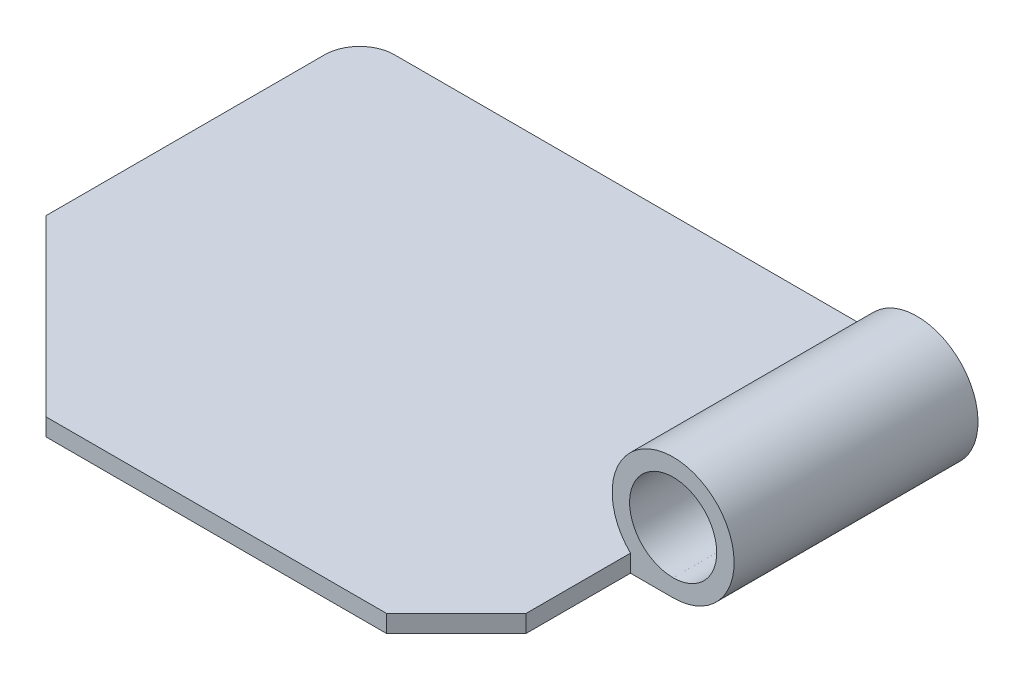
ISO-10303-21;
HEADER;
FILE_DESCRIPTION(('STEP AP214'),'2;1');
FILE_NAME('part.step','',(''),(''),'','','');
FILE_SCHEMA(('AUTOMOTIVE_DESIGN { 1 0 10303 214 1 1 1 1 }'));
ENDSEC;
DATA;
#1=APPLICATION_CONTEXT('core data for automotive mechanical design processes');
#2=APPLICATION_PROTOCOL_DEFINITION('international standard','automotive_design',2000,#1);
#3=PRODUCT_CONTEXT('',#1,'mechanical');
#4=PRODUCT('Part','Part','',(#3));
#5=PRODUCT_RELATED_PRODUCT_CATEGORY('part','',(#4));
#6=PRODUCT_DEFINITION_FORMATION('','',#4);
#7=PRODUCT_DEFINITION_CONTEXT('part definition',#1,'design');
#8=PRODUCT_DEFINITION('design','',#6,#7);
#9=PRODUCT_DEFINITION_SHAPE('','',#8);
#10=(LENGTH_UNIT() NAMED_UNIT(*) SI_UNIT(.MILLI.,.METRE.));
#11=(NAMED_UNIT(*) PLANE_ANGLE_UNIT() SI_UNIT($,.RADIAN.));
#12=(NAMED_UNIT(*) SI_UNIT($,.STERADIAN.) SOLID_ANGLE_UNIT());
#13=UNCERTAINTY_MEASURE_WITH_UNIT(LENGTH_MEASURE(1.E-05),#10,'distance_accuracy_value','');
#14=(GEOMETRIC_REPRESENTATION_CONTEXT(3) GLOBAL_UNCERTAINTY_ASSIGNED_CONTEXT((#13)) GLOBAL_UNIT_ASSIGNED_CONTEXT((#10,
#11,#12)) REPRESENTATION_CONTEXT('',''));
#15=CARTESIAN_POINT('',(0.,0.,0.));
#16=DIRECTION('',(0.,0.,1.));
#17=DIRECTION('',(1.,0.,0.));
#18=AXIS2_PLACEMENT_3D('',#15,#16,#17);
#19=CARTESIAN_POINT('',(-39.9995204977007,0.,-129.999520497701));
#20=DIRECTION('',(0.,-1.,0.));
#21=DIRECTION('',(0.,0.,-1.));
#22=AXIS2_PLACEMENT_3D('',#19,#20,#21);
#23=PLANE('',#22);
#24=DIRECTION('',(1.,0.,0.));
#25=VECTOR('',#24,1.);
#26=CARTESIAN_POINT('',(-39.9995204977007,0.,-49.9969797719556));
#27=LINE('',#26,#25);
#28=CARTESIAN_POINT('',(117.74001933084,0.,-49.9969797719556));
#29=VERTEX_POINT('',#28);
#30=CARTESIAN_POINT('',(117.746979771956,0.,-49.9969797719556));
#31=VERTEX_POINT('',#30);
#32=EDGE_CURVE('E11',#29,#31,#27,.T.);
#33=ORIENTED_EDGE('',*,*,#32,.F.);
#34=DIRECTION('',(0.,0.,-1.));
#35=VECTOR('',#34,1.);
#36=CARTESIAN_POINT('',(117.74001933084,0.,-49.9969797719556));
#37=LINE('',#36,#35);
#38=CARTESIAN_POINT('',(117.74001933084,0.,-119.996979771956));
#39=VERTEX_POINT('',#38);
#40=EDGE_CURVE('E46',#29,#39,#37,.T.);
#41=ORIENTED_EDGE('',*,*,#40,.T.);
#42=DIRECTION('',(1.,0.,0.));
#43=VECTOR('',#42,1.);
#44=CARTESIAN_POINT('',(-39.9995204977007,0.,-119.996979771956));
#45=LINE('',#44,#43);
#46=CARTESIAN_POINT('',(117.750479502299,0.,-119.996979771956));
#47=VERTEX_POINT('',#46);
#48=EDGE_CURVE('E191',#39,#47,#45,.T.);
#49=ORIENTED_EDGE('',*,*,#48,.T.);
#50=DIRECTION('',(0.,0.,-1.));
#51=VECTOR('',#50,1.);
#52=CARTESIAN_POINT('',(117.750479502299,0.,-119.996979771956));
#53=LINE('',#52,#51);
#54=CARTESIAN_POINT('',(117.750479502299,0.,-139.999520497701));
#55=VERTEX_POINT('',#54);
#56=EDGE_CURVE('E158',#47,#55,#53,.T.);
#57=ORIENTED_EDGE('',*,*,#56,.T.);
#58=DIRECTION('',(-1.,0.,0.));
#59=VECTOR('',#58,1.);
#60=CARTESIAN_POINT('',(117.750479502299,0.,-139.999520497701));
#61=LINE('',#60,#59);
#62=CARTESIAN_POINT('',(-39.9995204977007,0.,-139.999520497701));
#63=VERTEX_POINT('',#62);
#64=EDGE_CURVE('E161',#55,#63,#61,.T.);
#65=ORIENTED_EDGE('',*,*,#64,.T.);
#66=CARTESIAN_POINT('',(-39.9995204977007,0.,-129.999520497701));
#67=DIRECTION('',(0.,1.,0.));
#68=DIRECTION('',(0.,0.,-1.));
#69=AXIS2_PLACEMENT_3D('',#66,#67,#68);
#70=CIRCLE('',#69,10.);
#71=CARTESIAN_POINT('',(-49.9995204977007,0.,-129.999520497701));
#72=VERTEX_POINT('',#71);
#73=EDGE_CURVE('E164',#63,#72,#70,.T.);
#74=ORIENTED_EDGE('',*,*,#73,.T.);
#75=DIRECTION('',(0.,0.,1.));
#76=VECTOR('',#75,1.);
#77=CARTESIAN_POINT('',(-49.9995204977007,0.,-129.999520497701));
#78=LINE('',#77,#76);
#79=CARTESIAN_POINT('',(-49.9995204977007,0.,-49.9995204977008));
#80=VERTEX_POINT('',#79);
#81=EDGE_CURVE('E167',#72,#80,#78,.T.);
#82=ORIENTED_EDGE('',*,*,#81,.T.);
#83=DIRECTION('',(0.707106781186546,0.,0.707106781186549));
#84=VECTOR('',#83,1.);
#85=CARTESIAN_POINT('',(-49.9995204977007,0.,-49.9995204977008));
#86=LINE('',#85,#84);
#87=CARTESIAN_POINT('',(0.,0.,0.));
#88=VERTEX_POINT('',#87);
#89=EDGE_CURVE('E220',#80,#88,#86,.T.);
#90=ORIENTED_EDGE('',*,*,#89,.T.);
#91=DIRECTION('',(1.,0.,0.));
#92=VECTOR('',#91,1.);
#93=CARTESIAN_POINT('',(0.,0.,0.));
#94=LINE('',#93,#92);
#95=CARTESIAN_POINT('',(97.75,0.,0.));
#96=VERTEX_POINT('',#95);
#97=EDGE_CURVE('E223',#88,#96,#94,.T.);
#98=ORIENTED_EDGE('',*,*,#97,.T.);
#99=DIRECTION('',(0.707106781186547,0.,-0.707106781186548));
#100=VECTOR('',#99,1.);
#101=CARTESIAN_POINT('',(97.75,0.,0.));
#102=LINE('',#101,#100);
#103=CARTESIAN_POINT('',(117.746979771956,0.,-19.9969797719556));
#104=VERTEX_POINT('',#103);
#105=EDGE_CURVE('E153',#96,#104,#102,.T.);
#106=ORIENTED_EDGE('',*,*,#105,.T.);
#107=DIRECTION('',(0.,0.,-1.));
#108=VECTOR('',#107,1.);
#109=CARTESIAN_POINT('',(117.746979771956,0.,-19.9969797719556));
#110=LINE('',#109,#108);
#111=EDGE_CURVE('E151',#104,#31,#110,.T.);
#112=ORIENTED_EDGE('',*,*,#111,.T.);
#113=EDGE_LOOP('',(#33,#41,#49,#57,#65,#74,#82,#90,#98,#106,#112));
#114=FACE_BOUND('',#113,.T.);
#115=ADVANCED_FACE('F38',(#114),#23,.F.);
#116=DIRECTION('',(0.,0.,-1.));
#117=VECTOR('',#116,1.);
#118=CARTESIAN_POINT('',(129.987472977843,-2.41671002654265E-06,-49.9969797719556));
#119=LINE('',#118,#117);
#120=CARTESIAN_POINT('',(129.987472977843,0.,-49.9969797719556));
#121=VERTEX_POINT('',#120);
#122=CARTESIAN_POINT('',(129.987472977843,-4.83342005482001E-06,-119.996979771956));
#123=VERTEX_POINT('',#122);
#124=EDGE_CURVE('E150',#121,#123,#119,.T.);
#125=ORIENTED_EDGE('',*,*,#124,.F.);
#126=DIRECTION('',(1.,0.,0.));
#127=VECTOR('',#126,1.);
#128=CARTESIAN_POINT('',(117.746979771956,0.,-49.9969797719556));
#129=LINE('',#128,#127);
#130=CARTESIAN_POINT('',(130.000479502299,0.,-49.9969797719556));
#131=VERTEX_POINT('',#130);
#132=EDGE_CURVE('E141',#121,#131,#129,.T.);
#133=ORIENTED_EDGE('',*,*,#132,.T.);
#134=DIRECTION('',(0.,0.,-1.));
#135=VECTOR('',#134,1.);
#136=CARTESIAN_POINT('',(130.000479502299,0.,-49.9969797719556));
#137=LINE('',#136,#135);
#138=CARTESIAN_POINT('',(130.000479502299,0.,-119.996979771956));
#139=VERTEX_POINT('',#138);
#140=EDGE_CURVE('E130',#131,#139,#137,.T.);
#141=ORIENTED_EDGE('',*,*,#140,.T.);
#142=DIRECTION('',(-1.,0.,0.));
#143=VECTOR('',#142,1.);
#144=CARTESIAN_POINT('',(117.750479502299,0.,-119.996979771956));
#145=LINE('',#144,#143);
#146=EDGE_CURVE('E140',#139,#123,#145,.T.);
#147=ORIENTED_EDGE('',*,*,#146,.T.);
#148=EDGE_LOOP('',(#125,#133,#141,#147));
#149=FACE_BOUND('',#148,.T.);
#150=ADVANCED_FACE('F149',(#149),#23,.F.);
#151=CARTESIAN_POINT('',(-49.9995204977007,-5.,-49.9995204977008));
#152=DIRECTION('',(-0.707106781186549,0.,0.707106781186546));
#153=DIRECTION('',(0.707106781186546,0.,0.707106781186549));
#154=AXIS2_PLACEMENT_3D('',#151,#152,#153);
#155=PLANE('',#154);
#156=ORIENTED_EDGE('',*,*,#89,.F.);
#157=DIRECTION('',(0.,1.,0.));
#158=VECTOR('',#157,1.);
#159=CARTESIAN_POINT('',(-49.9995204977007,-5.,-49.9995204977008));
#160=LINE('',#159,#158);
#161=CARTESIAN_POINT('',(-49.9995204977007,-5.,-49.9995204977008));
#162=VERTEX_POINT('',#161);
#163=EDGE_CURVE('E171',#162,#80,#160,.T.);
#164=ORIENTED_EDGE('',*,*,#163,.F.);
#165=DIRECTION('',(0.707106781186546,0.,0.707106781186549));
#166=VECTOR('',#165,1.);
#167=CARTESIAN_POINT('',(-49.9995204977007,-5.,-49.9995204977008));
#168=LINE('',#167,#166);
#169=CARTESIAN_POINT('',(0.,-5.,0.));
#170=VERTEX_POINT('',#169);
#171=EDGE_CURVE('E170',#162,#170,#168,.T.);
#172=ORIENTED_EDGE('',*,*,#171,.T.);
#173=DIRECTION('',(0.,1.,0.));
#174=VECTOR('',#173,1.);
#175=CARTESIAN_POINT('',(0.,-5.,0.));
#176=LINE('',#175,#174);
#177=EDGE_CURVE('E187',#170,#88,#176,.T.);
#178=ORIENTED_EDGE('',*,*,#177,.T.);
#179=EDGE_LOOP('',(#156,#164,#172,#178));
#180=FACE_BOUND('',#179,.T.);
#181=ADVANCED_FACE('F40',(#180),#155,.T.);
#182=CARTESIAN_POINT('',(-49.9995204977007,-5.,-129.999520497701));
#183=DIRECTION('',(-1.,0.,0.));
#184=DIRECTION('',(0.,0.,1.));
#185=AXIS2_PLACEMENT_3D('',#182,#183,#184);
#186=PLANE('',#185);
#187=ORIENTED_EDGE('',*,*,#81,.F.);
#188=DIRECTION('',(0.,1.,0.));
#189=VECTOR('',#188,1.);
#190=CARTESIAN_POINT('',(-49.9995204977007,-5.,-129.999520497701));
#191=LINE('',#190,#189);
#192=CARTESIAN_POINT('',(-49.9995204977007,-5.,-129.999520497701));
#193=VERTEX_POINT('',#192);
#194=EDGE_CURVE('E173',#193,#72,#191,.T.);
#195=ORIENTED_EDGE('',*,*,#194,.F.);
#196=DIRECTION('',(0.,0.,1.));
#197=VECTOR('',#196,1.);
#198=CARTESIAN_POINT('',(-49.9995204977007,-5.,-129.999520497701));
#199=LINE('',#198,#197);
#200=EDGE_CURVE('E189',#193,#162,#199,.T.);
#201=ORIENTED_EDGE('',*,*,#200,.T.);
#202=ORIENTED_EDGE('',*,*,#163,.T.);
#203=EDGE_LOOP('',(#187,#195,#201,#202));
#204=FACE_BOUND('',#203,.T.);
#205=ADVANCED_FACE('F212',(#204),#186,.T.);
#206=CARTESIAN_POINT('',(-39.9995204977007,-5.,-129.999520497701));
#207=DIRECTION('',(0.,1.,0.));
#208=DIRECTION('',(0.,0.,1.));
#209=AXIS2_PLACEMENT_3D('',#206,#207,#208);
#210=CYLINDRICAL_SURFACE('',#209,10.);
#211=ORIENTED_EDGE('',*,*,#73,.F.);
#212=DIRECTION('',(0.,1.,0.));
#213=VECTOR('',#212,1.);
#214=CARTESIAN_POINT('',(-39.9995204977007,-5.,-139.999520497701));
#215=LINE('',#214,#213);
#216=CARTESIAN_POINT('',(-39.9995204977007,-5.,-139.999520497701));
#217=VERTEX_POINT('',#216);
#218=EDGE_CURVE('E175',#217,#63,#215,.T.);
#219=ORIENTED_EDGE('',*,*,#218,.F.);
#220=CARTESIAN_POINT('',(-39.9995204977007,-5.,-129.999520497701));
#221=DIRECTION('',(0.,1.,0.));
#222=DIRECTION('',(0.,0.,-1.));
#223=AXIS2_PLACEMENT_3D('',#220,#221,#222);
#224=CIRCLE('',#223,10.);
#225=EDGE_CURVE('E261',#217,#193,#224,.T.);
#226=ORIENTED_EDGE('',*,*,#225,.T.);
#227=ORIENTED_EDGE('',*,*,#194,.T.);
#228=EDGE_LOOP('',(#211,#219,#226,#227));
#229=FACE_BOUND('',#228,.T.);
#230=ADVANCED_FACE('F263',(#229),#210,.T.);
#231=CARTESIAN_POINT('',(117.750479502299,-5.,-139.999520497701));
#232=DIRECTION('',(0.,0.,-1.));
#233=DIRECTION('',(-1.,0.,0.));
#234=AXIS2_PLACEMENT_3D('',#231,#232,#233);
#235=PLANE('',#234);
#236=ORIENTED_EDGE('',*,*,#64,.F.);
#237=DIRECTION('',(0.,1.,0.));
#238=VECTOR('',#237,1.);
#239=CARTESIAN_POINT('',(117.750479502299,-5.,-139.999520497701));
#240=LINE('',#239,#238);
#241=CARTESIAN_POINT('',(117.750479502299,-5.,-139.999520497701));
#242=VERTEX_POINT('',#241);
#243=EDGE_CURVE('E177',#242,#55,#240,.T.);
#244=ORIENTED_EDGE('',*,*,#243,.F.);
#245=DIRECTION('',(-1.,0.,0.));
#246=VECTOR('',#245,1.);
#247=CARTESIAN_POINT('',(117.750479502299,-5.,-139.999520497701));
#248=LINE('',#247,#246);
#249=EDGE_CURVE('E260',#242,#217,#248,.T.);
#250=ORIENTED_EDGE('',*,*,#249,.T.);
#251=ORIENTED_EDGE('',*,*,#218,.T.);
#252=EDGE_LOOP('',(#236,#244,#250,#251));
#253=FACE_BOUND('',#252,.T.);
#254=ADVANCED_FACE('F206',(#253),#235,.T.);
#255=CARTESIAN_POINT('',(117.750479502299,-5.,-119.996979771956));
#256=DIRECTION('',(1.,0.,0.));
#257=DIRECTION('',(0.,0.,-1.));
#258=AXIS2_PLACEMENT_3D('',#255,#256,#257);
#259=PLANE('',#258);
#260=ORIENTED_EDGE('',*,*,#56,.F.);
#261=DIRECTION('',(0.,1.,0.));
#262=VECTOR('',#261,1.);
#263=CARTESIAN_POINT('',(117.750479502299,-5.,-119.996979771956));
#264=LINE('',#263,#262);
#265=CARTESIAN_POINT('',(117.750479502299,-5.,-119.996979771956));
#266=VERTEX_POINT('',#265);
#267=EDGE_CURVE('E179',#266,#47,#264,.T.);
#268=ORIENTED_EDGE('',*,*,#267,.F.);
#269=DIRECTION('',(0.,0.,-1.));
#270=VECTOR('',#269,1.);
#271=CARTESIAN_POINT('',(117.750479502299,-5.,-119.996979771956));
#272=LINE('',#271,#270);
#273=EDGE_CURVE('E202',#266,#242,#272,.T.);
#274=ORIENTED_EDGE('',*,*,#273,.T.);
#275=ORIENTED_EDGE('',*,*,#243,.T.);
#276=EDGE_LOOP('',(#260,#268,#274,#275));
#277=FACE_BOUND('',#276,.T.);
#278=ADVANCED_FACE('F198',(#277),#259,.T.);
#279=CARTESIAN_POINT('',(117.750479502299,-5.,-119.996979771956));
#280=DIRECTION('',(0.,0.,-1.));
#281=DIRECTION('',(-1.,0.,0.));
#282=AXIS2_PLACEMENT_3D('',#279,#280,#281);
#283=PLANE('',#282);
#284=ORIENTED_EDGE('',*,*,#267,.T.);
#285=ORIENTED_EDGE('',*,*,#48,.F.);
#286=CARTESIAN_POINT('',(129.987472977843,12.4999951665799,-119.996979771956));
#287=DIRECTION('',(0.,0.,-1.));
#288=DIRECTION('',(-1.,0.,0.));
#289=AXIS2_PLACEMENT_3D('',#286,#287,#288);
#290=CIRCLE('',#289,17.5);
#291=CARTESIAN_POINT('',(130.000479502299,-5.,-119.996979771956));
#292=VERTEX_POINT('',#291);
#293=EDGE_CURVE('E147',#39,#292,#290,.T.);
#294=ORIENTED_EDGE('',*,*,#293,.T.);
#295=DIRECTION('',(-1.,0.,0.));
#296=VECTOR('',#295,1.);
#297=CARTESIAN_POINT('',(117.750479502299,-5.,-119.996979771956));
#298=LINE('',#297,#296);
#299=EDGE_CURVE('E253',#292,#266,#298,.T.);
#300=ORIENTED_EDGE('',*,*,#299,.T.);
#301=EDGE_LOOP('',(#284,#285,#294,#300));
#302=FACE_BOUND('',#301,.T.);
#303=ORIENTED_EDGE('',*,*,#146,.F.);
#304=CARTESIAN_POINT('',(129.987472977843,12.4999951665799,-119.996979771956));
#305=DIRECTION('',(0.,0.,-1.));
#306=DIRECTION('',(-1.,0.,0.));
#307=AXIS2_PLACEMENT_3D('',#304,#305,#306);
#308=CIRCLE('',#307,12.5);
#309=EDGE_CURVE('E136',#123,#139,#308,.T.);
#310=ORIENTED_EDGE('',*,*,#309,.F.);
#311=EDGE_LOOP('',(#303,#310));
#312=FACE_BOUND('',#311,.T.);
#313=ADVANCED_FACE('F271',(#302,#312),#283,.T.);
#314=CARTESIAN_POINT('',(117.746979771956,-5.,-49.9969797719556));
#315=DIRECTION('',(0.,0.,1.));
#316=DIRECTION('',(1.,0.,0.));
#317=AXIS2_PLACEMENT_3D('',#314,#315,#316);
#318=PLANE('',#317);
#319=CARTESIAN_POINT('',(129.987472977843,12.4999951665799,-49.9969797719556));
#320=DIRECTION('',(0.,0.,-1.));
#321=DIRECTION('',(-1.,0.,0.));
#322=AXIS2_PLACEMENT_3D('',#319,#320,#321);
#323=CIRCLE('',#322,12.5);
#324=EDGE_CURVE('E134',#121,#131,#323,.T.);
#325=ORIENTED_EDGE('',*,*,#324,.T.);
#326=ORIENTED_EDGE('',*,*,#132,.F.);
#327=EDGE_LOOP('',(#325,#326));
#328=FACE_BOUND('',#327,.T.);
#329=DIRECTION('',(1.,0.,0.));
#330=VECTOR('',#329,1.);
#331=CARTESIAN_POINT('',(117.746979771956,-5.,-49.9969797719556));
#332=LINE('',#331,#330);
#333=CARTESIAN_POINT('',(117.746979771956,-5.,-49.9969797719556));
#334=VERTEX_POINT('',#333);
#335=CARTESIAN_POINT('',(130.000479502299,-5.00000000000001,-49.9969797719556));
#336=VERTEX_POINT('',#335);
#337=EDGE_CURVE('E246',#334,#336,#332,.T.);
#338=ORIENTED_EDGE('',*,*,#337,.T.);
#339=CARTESIAN_POINT('',(129.987472977843,12.4999951665799,-49.9969797719556));
#340=DIRECTION('',(0.,0.,-1.));
#341=DIRECTION('',(-1.,0.,0.));
#342=AXIS2_PLACEMENT_3D('',#339,#340,#341);
#343=CIRCLE('',#342,17.5);
#344=EDGE_CURVE('E224',#29,#336,#343,.T.);
#345=ORIENTED_EDGE('',*,*,#344,.F.);
#346=ORIENTED_EDGE('',*,*,#32,.T.);
#347=DIRECTION('',(0.,1.,0.));
#348=VECTOR('',#347,1.);
#349=CARTESIAN_POINT('',(117.746979771956,-5.,-49.9969797719556));
#350=LINE('',#349,#348);
#351=EDGE_CURVE('E181',#334,#31,#350,.T.);
#352=ORIENTED_EDGE('',*,*,#351,.F.);
#353=EDGE_LOOP('',(#338,#345,#346,#352));
#354=FACE_BOUND('',#353,.T.);
#355=ADVANCED_FACE('F145',(#328,#354),#318,.T.);
#356=CARTESIAN_POINT('',(117.746979771956,-5.,-19.9969797719556));
#357=DIRECTION('',(1.,0.,0.));
#358=DIRECTION('',(0.,0.,-1.));
#359=AXIS2_PLACEMENT_3D('',#356,#357,#358);
#360=PLANE('',#359);
#361=ORIENTED_EDGE('',*,*,#111,.F.);
#362=DIRECTION('',(0.,1.,0.));
#363=VECTOR('',#362,1.);
#364=CARTESIAN_POINT('',(117.746979771956,-5.,-19.9969797719556));
#365=LINE('',#364,#363);
#366=CARTESIAN_POINT('',(117.746979771956,-5.,-19.9969797719556));
#367=VERTEX_POINT('',#366);
#368=EDGE_CURVE('E183',#367,#104,#365,.T.);
#369=ORIENTED_EDGE('',*,*,#368,.F.);
#370=DIRECTION('',(0.,0.,-1.));
#371=VECTOR('',#370,1.);
#372=CARTESIAN_POINT('',(117.746979771956,-5.,-19.9969797719556));
#373=LINE('',#372,#371);
#374=EDGE_CURVE('E243',#367,#334,#373,.T.);
#375=ORIENTED_EDGE('',*,*,#374,.T.);
#376=ORIENTED_EDGE('',*,*,#351,.T.);
#377=EDGE_LOOP('',(#361,#369,#375,#376));
#378=FACE_BOUND('',#377,.T.);
#379=ADVANCED_FACE('F242',(#378),#360,.T.);
#380=CARTESIAN_POINT('',(97.75,-5.,0.));
#381=DIRECTION('',(0.707106781186548,0.,0.707106781186547));
#382=DIRECTION('',(0.707106781186547,0.,-0.707106781186548));
#383=AXIS2_PLACEMENT_3D('',#380,#381,#382);
#384=PLANE('',#383);
#385=ORIENTED_EDGE('',*,*,#105,.F.);
#386=DIRECTION('',(0.,1.,0.));
#387=VECTOR('',#386,1.);
#388=CARTESIAN_POINT('',(97.75,-5.,0.));
#389=LINE('',#388,#387);
#390=CARTESIAN_POINT('',(97.75,-5.,0.));
#391=VERTEX_POINT('',#390);
#392=EDGE_CURVE('E185',#391,#96,#389,.T.);
#393=ORIENTED_EDGE('',*,*,#392,.F.);
#394=DIRECTION('',(0.707106781186547,0.,-0.707106781186548));
#395=VECTOR('',#394,1.);
#396=CARTESIAN_POINT('',(97.75,-5.,0.));
#397=LINE('',#396,#395);
#398=EDGE_CURVE('E238',#391,#367,#397,.T.);
#399=ORIENTED_EDGE('',*,*,#398,.T.);
#400=ORIENTED_EDGE('',*,*,#368,.T.);
#401=EDGE_LOOP('',(#385,#393,#399,#400));
#402=FACE_BOUND('',#401,.T.);
#403=ADVANCED_FACE('F235',(#402),#384,.T.);
#404=CARTESIAN_POINT('',(0.,-5.,0.));
#405=DIRECTION('',(0.,0.,1.));
#406=DIRECTION('',(1.,0.,0.));
#407=AXIS2_PLACEMENT_3D('',#404,#405,#406);
#408=PLANE('',#407);
#409=ORIENTED_EDGE('',*,*,#97,.F.);
#410=ORIENTED_EDGE('',*,*,#177,.F.);
#411=DIRECTION('',(1.,0.,0.));
#412=VECTOR('',#411,1.);
#413=CARTESIAN_POINT('',(0.,-5.,0.));
#414=LINE('',#413,#412);
#415=EDGE_CURVE('E266',#170,#391,#414,.T.);
#416=ORIENTED_EDGE('',*,*,#415,.T.);
#417=ORIENTED_EDGE('',*,*,#392,.T.);
#418=EDGE_LOOP('',(#409,#410,#416,#417));
#419=FACE_BOUND('',#418,.T.);
#420=ADVANCED_FACE('F282',(#419),#408,.T.);
#421=CARTESIAN_POINT('',(-39.9995204977007,-5.,-129.999520497701));
#422=DIRECTION('',(0.,-1.,0.));
#423=DIRECTION('',(0.,0.,-1.));
#424=AXIS2_PLACEMENT_3D('',#421,#422,#423);
#425=PLANE('',#424);
#426=ORIENTED_EDGE('',*,*,#273,.F.);
#427=ORIENTED_EDGE('',*,*,#299,.F.);
#428=DIRECTION('',(0.,0.,-1.));
#429=VECTOR('',#428,1.);
#430=CARTESIAN_POINT('',(130.000479502299,-5.,-49.9969797719556));
#431=LINE('',#430,#429);
#432=EDGE_CURVE('E251',#336,#292,#431,.T.);
#433=ORIENTED_EDGE('',*,*,#432,.F.);
#434=ORIENTED_EDGE('',*,*,#337,.F.);
#435=ORIENTED_EDGE('',*,*,#374,.F.);
#436=ORIENTED_EDGE('',*,*,#398,.F.);
#437=ORIENTED_EDGE('',*,*,#415,.F.);
#438=ORIENTED_EDGE('',*,*,#171,.F.);
#439=ORIENTED_EDGE('',*,*,#200,.F.);
#440=ORIENTED_EDGE('',*,*,#225,.F.);
#441=ORIENTED_EDGE('',*,*,#249,.F.);
#442=EDGE_LOOP('',(#426,#427,#433,#434,#435,#436,#437,#438,#439,#440,#441));
#443=FACE_BOUND('',#442,.T.);
#444=ADVANCED_FACE('F249',(#443),#425,.T.);
#445=CARTESIAN_POINT('',(129.987472977843,12.4999951665799,-49.9969797719556));
#446=DIRECTION('',(0.,0.,-1.));
#447=DIRECTION('',(-1.,0.,0.));
#448=AXIS2_PLACEMENT_3D('',#445,#446,#447);
#449=CYLINDRICAL_SURFACE('',#448,17.5);
#450=ORIENTED_EDGE('',*,*,#344,.T.);
#451=ORIENTED_EDGE('',*,*,#432,.T.);
#452=ORIENTED_EDGE('',*,*,#293,.F.);
#453=ORIENTED_EDGE('',*,*,#40,.F.);
#454=EDGE_LOOP('',(#450,#451,#452,#453));
#455=FACE_BOUND('',#454,.T.);
#456=ADVANCED_FACE('F274',(#455),#449,.T.);
#457=CARTESIAN_POINT('',(129.987472977843,12.4999951665799,-49.9969797719556));
#458=DIRECTION('',(0.,0.,-1.));
#459=DIRECTION('',(-1.,0.,0.));
#460=AXIS2_PLACEMENT_3D('',#457,#458,#459);
#461=CYLINDRICAL_SURFACE('',#460,12.5);
#462=ORIENTED_EDGE('',*,*,#140,.F.);
#463=ORIENTED_EDGE('',*,*,#324,.F.);
#464=ORIENTED_EDGE('',*,*,#124,.T.);
#465=ORIENTED_EDGE('',*,*,#309,.T.);
#466=EDGE_LOOP('',(#462,#463,#464,#465));
#467=FACE_BOUND('',#466,.T.);
#468=ADVANCED_FACE('F132',(#467),#461,.F.);
#469=CLOSED_SHELL('',(#115,#150,#181,#205,#230,#254,#278,#313,#355,#379,#403,#420,#444,#456,#468));
#470=MANIFOLD_SOLID_BREP('B2',#469);
#471=ADVANCED_BREP_SHAPE_REPRESENTATION('',(#18,#470),#14);
#472=SHAPE_DEFINITION_REPRESENTATION(#9,#471);
ENDSEC;
END-ISO-10303-21;
